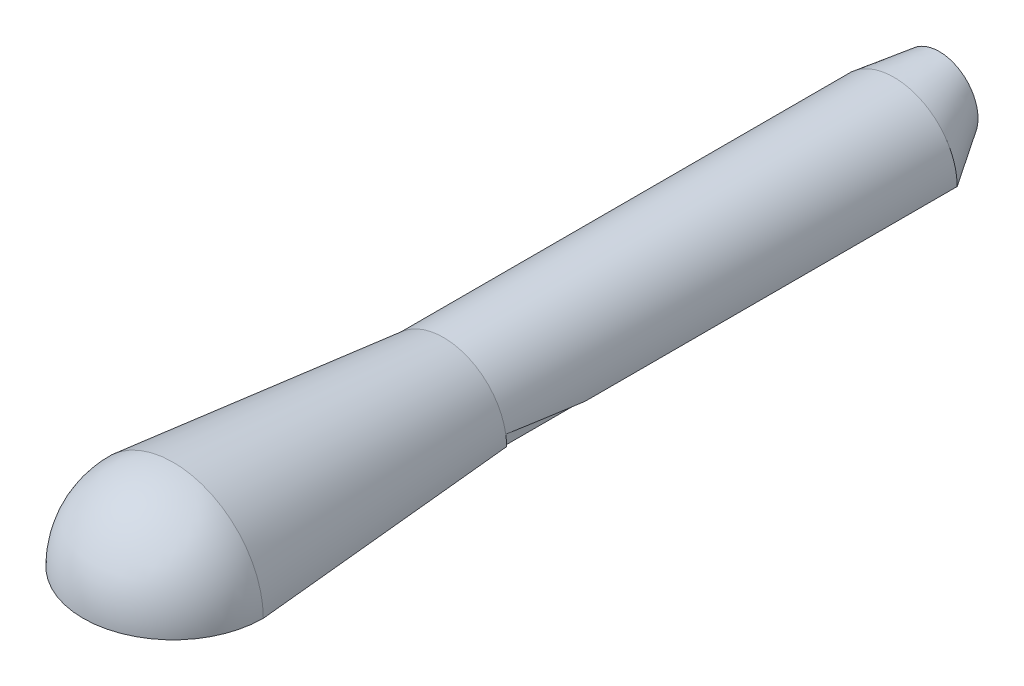
ISO-10303-21;
HEADER;
FILE_DESCRIPTION(('STEP AP214'),'2;1');
FILE_NAME('part.step','',(''),(''),'','','');
FILE_SCHEMA(('AUTOMOTIVE_DESIGN { 1 0 10303 214 1 1 1 1 }'));
ENDSEC;
DATA;
#1=APPLICATION_CONTEXT('core data for automotive mechanical design processes');
#2=APPLICATION_PROTOCOL_DEFINITION('international standard','automotive_design',2000,#1);
#3=PRODUCT_CONTEXT('',#1,'mechanical');
#4=PRODUCT('Part','Part','',(#3));
#5=PRODUCT_RELATED_PRODUCT_CATEGORY('part','',(#4));
#6=PRODUCT_DEFINITION_FORMATION('','',#4);
#7=PRODUCT_DEFINITION_CONTEXT('part definition',#1,'design');
#8=PRODUCT_DEFINITION('design','',#6,#7);
#9=PRODUCT_DEFINITION_SHAPE('','',#8);
#10=(LENGTH_UNIT() NAMED_UNIT(*) SI_UNIT(.MILLI.,.METRE.));
#11=(NAMED_UNIT(*) PLANE_ANGLE_UNIT() SI_UNIT($,.RADIAN.));
#12=(NAMED_UNIT(*) SI_UNIT($,.STERADIAN.) SOLID_ANGLE_UNIT());
#13=UNCERTAINTY_MEASURE_WITH_UNIT(LENGTH_MEASURE(1.E-05),#10,'distance_accuracy_value','');
#14=(GEOMETRIC_REPRESENTATION_CONTEXT(3) GLOBAL_UNCERTAINTY_ASSIGNED_CONTEXT((#13)) GLOBAL_UNIT_ASSIGNED_CONTEXT((#10,
#11,#12)) REPRESENTATION_CONTEXT('',''));
#15=CARTESIAN_POINT('',(0.,0.,0.));
#16=DIRECTION('',(0.,0.,1.));
#17=DIRECTION('',(1.,0.,0.));
#18=AXIS2_PLACEMENT_3D('',#15,#16,#17);
#19=CARTESIAN_POINT('',(0.,0.,0.));
#20=DIRECTION('',(0.,-1.,0.));
#21=DIRECTION('',(1.,0.,0.));
#22=AXIS2_PLACEMENT_3D('',#19,#20,#21);
#23=SPHERICAL_SURFACE('',#22,100.);
#24=CARTESIAN_POINT('',(0.,0.,0.));
#25=DIRECTION('',(0.,-1.,0.));
#26=DIRECTION('',(0.,0.,-1.));
#27=AXIS2_PLACEMENT_3D('',#24,#25,#26);
#28=CIRCLE('',#27,100.);
#29=CARTESIAN_POINT('',(100.,0.,-6.98296267768627E-13));
#30=VERTEX_POINT('',#29);
#31=CARTESIAN_POINT('',(-100.,0.,6.98296267768627E-13));
#32=VERTEX_POINT('',#31);
#33=EDGE_CURVE('E110',#30,#32,#28,.T.);
#34=ORIENTED_EDGE('',*,*,#33,.F.);
#35=CARTESIAN_POINT('',(100.,0.,-6.98296267768627E-13));
#36=CARTESIAN_POINT('',(100.000034708878,1.63624782608904,-6.98296510139423E-13));
#37=CARTESIAN_POINT('',(99.9598417125153,3.27249269879273,-6.98015843945921E-13));
#38=CARTESIAN_POINT('',(99.7992495285192,6.54104216669093,-6.96894434718748E-13));
#39=CARTESIAN_POINT('',(99.6788503408854,8.17334676188544,-6.96053691685078E-13));
#40=CARTESIAN_POINT('',(99.358094993554,11.4300813040267,-6.93813869065994E-13));
#41=CARTESIAN_POINT('',(99.1577388338565,13.0545112509735,-6.92414789480582E-13));
#42=CARTESIAN_POINT('',(98.6775631590997,16.2915836400989,-6.89061740665023E-13));
#43=CARTESIAN_POINT('',(98.3977436440406,17.9042260822774,-6.87107771434876E-13));
#44=CARTESIAN_POINT('',(97.7593124366055,21.1138383209483,-6.82649630141087E-13));
#45=CARTESIAN_POINT('',(97.4007007442297,22.7108081174406,-6.80145458077445E-13));
#46=CARTESIAN_POINT('',(96.6055498946791,25.8852278632122,-6.74592949371903E-13));
#47=CARTESIAN_POINT('',(96.1690107375045,27.4626778124916,-6.71544612730003E-13));
#48=CARTESIAN_POINT('',(95.2190564089373,30.5942576384009,-6.64911117108113E-13));
#49=CARTESIAN_POINT('',(94.7056412375449,32.1483875150308,-6.61325958128121E-13));
#50=CARTESIAN_POINT('',(93.6031717990593,35.2295831634133,-6.53627455185887E-13));
#51=CARTESIAN_POINT('',(93.0141175319661,36.7566489351659,-6.49514111223643E-13));
#52=CARTESIAN_POINT('',(91.7617889702913,39.7800375378521,-6.40769147617267E-13));
#53=CARTESIAN_POINT('',(91.0985146757097,41.2763603687857,-6.36137527973135E-13));
#54=CARTESIAN_POINT('',(89.699343948979,44.2346583172707,-6.26367171008664E-13));
#55=CARTESIAN_POINT('',(88.9634475168299,45.6966334348222,-6.21228433688324E-13));
#56=CARTESIAN_POINT('',(87.4208053528411,48.5827139303774,-6.10456221032165E-13));
#57=CARTESIAN_POINT('',(86.6140596210015,50.0068193083813,-6.04822745696346E-13));
#58=CARTESIAN_POINT('',(84.9316623790529,52.8137295302631,-5.93074628546778E-13));
#59=CARTESIAN_POINT('',(84.0560108689441,54.1965343741412,-5.86959986733028E-13));
#60=CARTESIAN_POINT('',(82.237911591565,56.9175122297793,-5.74264267334761E-13));
#61=CARTESIAN_POINT('',(81.2954638242948,58.2556852415394,-5.67683189750245E-13));
#62=CARTESIAN_POINT('',(79.3460424718342,60.8841756569473,-5.54070453202927E-13));
#63=CARTESIAN_POINT('',(78.3390688866436,62.1744930605951,-5.47038794240126E-13));
#64=CARTESIAN_POINT('',(76.2630217859038,64.7041637721341,-5.32541834818541E-13));
#65=CARTESIAN_POINT('',(75.1939482703545,65.9435170800254,-5.25076534359757E-13));
#66=CARTESIAN_POINT('',(72.9962768006373,68.3682738893783,-5.09730276508906E-13));
#67=CARTESIAN_POINT('',(71.8676788464695,69.55367739084,-5.01849319116839E-13));
#68=CARTESIAN_POINT('',(69.55367739084,71.8676788464695,-4.85690733316067E-13));
#69=CARTESIAN_POINT('',(68.3682738893783,72.9962768006373,-4.77413104907361E-13));
#70=CARTESIAN_POINT('',(65.9435170800254,75.1939482703545,-4.60481118605184E-13));
#71=CARTESIAN_POINT('',(64.7041637721341,76.2630217859038,-4.51826760711712E-13));
#72=CARTESIAN_POINT('',(62.174493060595,78.3390688866436,-4.34162164546199E-13));
#73=CARTESIAN_POINT('',(60.8841756569473,79.3460424718342,-4.25151926274158E-13));
#74=CARTESIAN_POINT('',(58.2556852415394,81.2954638242948,-4.06797275804708E-13));
#75=CARTESIAN_POINT('',(56.9175122297793,82.237911591565,-3.974528636073E-13));
#76=CARTESIAN_POINT('',(54.1965343741412,84.0560108689441,-3.78452376794569E-13));
#77=CARTESIAN_POINT('',(52.8137295302631,84.931662379053,-3.68796302179244E-13));
#78=CARTESIAN_POINT('',(50.0068193083812,86.6140596210015,-3.49195752860227E-13));
#79=CARTESIAN_POINT('',(48.5827139303774,87.4208053528411,-3.39251278156534E-13));
#80=CARTESIAN_POINT('',(45.6966334348222,88.9634475168299,-3.19097885771274E-13));
#81=CARTESIAN_POINT('',(44.2346583172707,89.699343948979,-3.08888968089706E-13));
#82=CARTESIAN_POINT('',(41.2763603687857,91.0985146757097,-2.88231283925959E-13));
#83=CARTESIAN_POINT('',(39.7800375378521,91.7617889702913,-2.7778251744378E-13));
#84=CARTESIAN_POINT('',(36.7566489351659,93.0141175319661,-2.5667030767108E-13));
#85=CARTESIAN_POINT('',(35.2295831634133,93.6031717990593,-2.46006864380559E-13));
#86=CARTESIAN_POINT('',(32.1483875150308,94.7056412375449,-2.24490990165255E-13));
#87=CARTESIAN_POINT('',(30.5942576384009,95.2190564089373,-2.13638559240471E-13));
#88=CARTESIAN_POINT('',(27.4626778124916,96.1690107375045,-1.91770854193952E-13));
#89=CARTESIAN_POINT('',(25.8852278632122,96.6055498946791,-1.80755580072216E-13));
#90=CARTESIAN_POINT('',(22.7108081174406,97.4007007442297,-1.58588725464182E-13));
#91=CARTESIAN_POINT('',(21.1138383209483,97.7593124366055,-1.47437144977884E-13));
#92=CARTESIAN_POINT('',(17.9042260822774,98.3977436440406,-1.250245425054E-13));
#93=CARTESIAN_POINT('',(16.2915836400989,98.6775631590997,-1.13763520519215E-13));
#94=CARTESIAN_POINT('',(13.0545112509735,99.1577388338565,0.));
#95=CARTESIAN_POINT('',(11.4300813040267,99.358094993554,0.));
#96=CARTESIAN_POINT('',(8.17334676188544,99.6788503408854,0.));
#97=CARTESIAN_POINT('',(6.54104216669093,99.7992495285192,0.));
#98=CARTESIAN_POINT('',(3.27249269879272,99.9598417125153,0.));
#99=CARTESIAN_POINT('',(1.63624782608903,100.000034708878,0.));
#100=CARTESIAN_POINT('',(0.,100.,0.));
#101=B_SPLINE_CURVE_WITH_KNOTS('',3,(#35,#36,#37,#38,#39,#40,#41,#42,#43,#44,#45,#46,#47,#48,
#49,#50,#51,#52,#53,#54,#55,#56,#57,#58,#59,#60,#61,#62,#63,#64,#65,#66,#67,#68,#69,#70,#71,#72,
#73,#74,#75,#76,#77,#78,#79,#80,#81,#82,#83,#84,#85,#86,#87,#88,#89,#90,#91,#92,#93,#94,#95,#96,
#97,#98,#99,#100),.UNSPECIFIED.,.F.,.F.,(4,2,2,2,2,2,2,2,2,2,2,2,2,2,2,2,2,2,2,2,2,2,2,2,2,2,2,
2,2,2,2,2,4),(0.,4.90824570458246,9.81649140916492,14.7247371137474,19.6329828183298,
24.5412285229123,29.4494742274947,34.3577199320772,39.2659656366597,44.1742113412421,
49.0824570458246,53.990702750407,58.8989484549895,63.8071941595719,68.7154398641544,
73.6236855687368,78.5319312733193,83.4401769779018,88.3484226824842,93.2566683870667,
98.1649140916491,103.073159796232,107.981405500814,112.889651205396,117.797896909979,
122.706142614561,127.614388319144,132.522634023726,137.430879728309,142.339125432891,
147.247371137474,152.155616842056,157.063862546639),.UNSPECIFIED.);
#102=CARTESIAN_POINT('',(0.,100.000104880312,0.));
#103=VERTEX_POINT('',#102);
#104=EDGE_CURVE('E125',#30,#103,#101,.T.);
#105=ORIENTED_EDGE('',*,*,#104,.T.);
#106=CARTESIAN_POINT('',(0.,100.,0.));
#107=CARTESIAN_POINT('',(-1.636247826089,100.000034708878,0.));
#108=CARTESIAN_POINT('',(-3.2724926987927,99.9598417125153,0.));
#109=CARTESIAN_POINT('',(-6.5410421666909,99.7992495285192,0.));
#110=CARTESIAN_POINT('',(-8.17334676188541,99.6788503408854,0.));
#111=CARTESIAN_POINT('',(-11.4300813040267,99.358094993554,0.));
#112=CARTESIAN_POINT('',(-13.0545112509735,99.1577388338565,0.));
#113=CARTESIAN_POINT('',(-16.2915836400988,98.6775631590997,1.15758664095003E-13));
#114=CARTESIAN_POINT('',(-17.9042260822774,98.3977436440406,1.27217177821687E-13));
#115=CARTESIAN_POINT('',(-21.1138383209482,97.7593124366055,1.5002284442963E-13));
#116=CARTESIAN_POINT('',(-22.7108081174405,97.4007007442297,1.61369997310889E-13));
#117=CARTESIAN_POINT('',(-25.8852278632122,96.6055498946791,1.83925606217004E-13));
#118=CARTESIAN_POINT('',(-27.4626778124916,96.1690107375045,1.9513406224186E-13));
#119=CARTESIAN_POINT('',(-30.5942576384008,95.2190564089373,2.17385275209387E-13));
#120=CARTESIAN_POINT('',(-32.1483875150307,94.7056412375449,2.28428032152058E-13));
#121=CARTESIAN_POINT('',(-35.2295831634132,93.6031717990593,2.50321244006196E-13));
#122=CARTESIAN_POINT('',(-36.7566489351659,93.0141175319661,2.61171698917663E-13));
#123=CARTESIAN_POINT('',(-39.7800375378521,91.7617889702913,2.82654167007849E-13));
#124=CARTESIAN_POINT('',(-41.2763603687857,91.0985146757097,2.93286180186568E-13));
#125=CARTESIAN_POINT('',(-44.2346583172707,89.699343948979,3.14306151361668E-13));
#126=CARTESIAN_POINT('',(-45.6966334348221,88.9634475168299,3.2469410935805E-13));
#127=CARTESIAN_POINT('',(-48.5827139303774,87.4208053528411,3.45200944667407E-13));
#128=CARTESIAN_POINT('',(-50.0068193083812,86.6140596210015,3.55319821980382E-13));
#129=CARTESIAN_POINT('',(-52.8137295302631,84.931662379053,3.75264118661271E-13));
#130=CARTESIAN_POINT('',(-54.1965343741411,84.0560108689441,3.85089538029185E-13));
#131=CARTESIAN_POINT('',(-56.9175122297793,82.237911591565,4.04423248524063E-13));
#132=CARTESIAN_POINT('',(-58.2556852415394,81.2954638242948,4.13931539651027E-13));
#133=CARTESIAN_POINT('',(-60.8841756569473,79.3460424718342,4.32608087357858E-13));
#134=CARTESIAN_POINT('',(-62.174493060595,78.3390688866436,4.41776343937725E-13));
#135=CARTESIAN_POINT('',(-64.7041637721341,76.2630217859038,4.59750735417217E-13));
#136=CARTESIAN_POINT('',(-65.9435170800253,75.1939482703545,4.68556870316841E-13));
#137=CARTESIAN_POINT('',(-68.3682738893783,72.9962768006373,4.85785803685547E-13));
#138=CARTESIAN_POINT('',(-69.55367739084,71.8676788464695,4.94208602154629E-13));
#139=CARTESIAN_POINT('',(-71.8676788464695,69.55367739084,5.10650571402987E-13));
#140=CARTESIAN_POINT('',(-72.9962768006373,68.3682738893783,5.18669742182264E-13));
#141=CARTESIAN_POINT('',(-75.1939482703545,65.9435170800254,5.34285137166211E-13));
#142=CARTESIAN_POINT('',(-76.2630217859038,64.7041637721341,5.41881361370882E-13));
#143=CARTESIAN_POINT('',(-78.3390688866436,62.174493060595,5.56632563236147E-13));
#144=CARTESIAN_POINT('',(-79.3460424718341,60.8841756569473,5.63787540896741E-13));
#145=CARTESIAN_POINT('',(-81.2954638242948,58.2556852415394,5.77639012706007E-13));
#146=CARTESIAN_POINT('',(-82.237911591565,56.9175122297793,5.84335506854678E-13));
#147=CARTESIAN_POINT('',(-84.056010868944,54.1965343741412,5.97253879199002E-13));
#148=CARTESIAN_POINT('',(-84.9316623790529,52.8137295302631,6.03475757394654E-13));
#149=CARTESIAN_POINT('',(-86.6140596210015,50.0068193083812,6.15429908783948E-13));
#150=CARTESIAN_POINT('',(-87.4208053528411,48.5827139303774,6.21162181977589E-13));
#151=CARTESIAN_POINT('',(-88.9634475168299,45.6966334348222,6.32123313812584E-13));
#152=CARTESIAN_POINT('',(-89.6993439489789,44.2346583172707,6.37352172453937E-13));
#153=CARTESIAN_POINT('',(-91.0985146757097,41.2763603687857,6.47293878413604E-13));
#154=CARTESIAN_POINT('',(-91.7617889702913,39.7800375378521,6.52006725731917E-13));
#155=CARTESIAN_POINT('',(-93.0141175319661,36.7566489351659,6.60905055354747E-13));
#156=CARTESIAN_POINT('',(-93.6031717990593,35.2295831634133,6.65090537659262E-13));
#157=CARTESIAN_POINT('',(-94.7056412375449,32.1483875150308,6.72924054168397E-13));
#158=CARTESIAN_POINT('',(-95.2190564089373,30.5942576384009,6.76572088373016E-13));
#159=CARTESIAN_POINT('',(-96.1690107375044,27.4626778124916,6.83321919847688E-13));
#160=CARTESIAN_POINT('',(-96.6055498946791,25.8852278632122,6.86423717117741E-13));
#161=CARTESIAN_POINT('',(-97.4007007442296,22.7108081174406,6.92073603717558E-13));
#162=CARTESIAN_POINT('',(-97.7593124366055,21.1138383209483,6.94621693047321E-13));
#163=CARTESIAN_POINT('',(-98.3977436440405,17.9042260822774,6.99158019614576E-13));
#164=CARTESIAN_POINT('',(-98.6775631590997,16.2915836400989,7.01146256852068E-13));
#165=CARTESIAN_POINT('',(-99.1577388338564,13.0545112509735,7.04558110227939E-13));
#166=CARTESIAN_POINT('',(-99.358094993554,11.4300813040267,7.05981726366318E-13));
#167=CARTESIAN_POINT('',(-99.6788503408853,8.17334676188543,7.08260830186343E-13));
#168=CARTESIAN_POINT('',(-99.7992495285192,6.54104216669092,7.09116317867989E-13));
#169=CARTESIAN_POINT('',(-99.9598417125152,3.27249269879272,7.10257393965572E-13));
#170=CARTESIAN_POINT('',(-100.000034708877,1.63624782608903,7.10542982381508E-13));
#171=CARTESIAN_POINT('',(-100.,0.,7.105427357601E-13));
#172=B_SPLINE_CURVE_WITH_KNOTS('',3,(#106,#107,#108,#109,#110,#111,#112,#113,#114,#115,#116,
#117,#118,#119,#120,#121,#122,#123,#124,#125,#126,#127,#128,#129,#130,#131,#132,#133,#134,#135,
#136,#137,#138,#139,#140,#141,#142,#143,#144,#145,#146,#147,#148,#149,#150,#151,#152,#153,#154,
#155,#156,#157,#158,#159,#160,#161,#162,#163,#164,#165,#166,#167,#168,#169,#170,#171),
.UNSPECIFIED.,.F.,.F.,(4,2,2,2,2,2,2,2,2,2,2,2,2,2,2,2,2,2,2,2,2,2,2,2,2,2,2,2,2,2,2,2,4),(0.,
4.90824570458246,9.81649140916493,14.7247371137474,19.6329828183298,24.5412285229123,
29.4494742274947,34.3577199320772,39.2659656366597,44.1742113412421,49.0824570458246,
53.990702750407,58.8989484549895,63.8071941595719,68.7154398641544,73.6236855687368,
78.5319312733193,83.4401769779018,88.3484226824842,93.2566683870667,98.1649140916491,
103.073159796232,107.981405500814,112.889651205397,117.797896909979,122.706142614561,
127.614388319144,132.522634023726,137.430879728309,142.339125432891,147.247371137474,
152.155616842056,157.063862546639),.UNSPECIFIED.);
#173=EDGE_CURVE('E307',#103,#32,#172,.T.);
#174=ORIENTED_EDGE('',*,*,#173,.T.);
#175=EDGE_LOOP('',(#34,#105,#174));
#176=FACE_BOUND('',#175,.T.);
#177=ADVANCED_FACE('F98',(#176),#23,.T.);
#178=CARTESIAN_POINT('',(0.,0.,0.));
#179=DIRECTION('',(0.,1.,0.));
#180=DIRECTION('',(0.,0.,1.));
#181=AXIS2_PLACEMENT_3D('',#178,#179,#180);
#182=PLANE('',#181);
#183=DIRECTION('',(0.,0.,-1.));
#184=VECTOR('',#183,1.);
#185=CARTESIAN_POINT('',(68.,-4.88807387438039E-13,-300.000000000001));
#186=LINE('',#185,#184);
#187=CARTESIAN_POINT('',(68.,-4.88807387438039E-13,-300.000000000001));
#188=VERTEX_POINT('',#187);
#189=CARTESIAN_POINT('',(68.,-4.78083155417905E-13,-387.57));
#190=VERTEX_POINT('',#189);
#191=EDGE_CURVE('E182',#188,#190,#186,.T.);
#192=ORIENTED_EDGE('',*,*,#191,.F.);
#193=DIRECTION('',(1.,0.,0.));
#194=VECTOR('',#193,1.);
#195=CARTESIAN_POINT('',(68.,-4.88807387438039E-13,-300.000000000001));
#196=LINE('',#195,#194);
#197=CARTESIAN_POINT('',(70.,-4.88807387438039E-13,-300.000000000001));
#198=VERTEX_POINT('',#197);
#199=EDGE_CURVE('E164',#188,#198,#196,.T.);
#200=ORIENTED_EDGE('',*,*,#199,.T.);
#201=DIRECTION('',(0.0995037190210059,0.,0.995037190209988));
#202=VECTOR('',#201,1.);
#203=CARTESIAN_POINT('',(84.999999999999,0.,-150.000000000001));
#204=LINE('',#203,#202);
#205=EDGE_CURVE('E103',#198,#30,#204,.T.);
#206=ORIENTED_EDGE('',*,*,#205,.T.);
#207=ORIENTED_EDGE('',*,*,#33,.T.);
#208=DIRECTION('',(-0.099503719020992,0.,0.99503719020999));
#209=VECTOR('',#208,1.);
#210=CARTESIAN_POINT('',(-85.0000000000011,0.,-149.999999999999));
#211=LINE('',#210,#209);
#212=CARTESIAN_POINT('',(-70.0000000000021,0.,-299.999999999999));
#213=VERTEX_POINT('',#212);
#214=EDGE_CURVE('E310',#213,#32,#211,.T.);
#215=ORIENTED_EDGE('',*,*,#214,.F.);
#216=DIRECTION('',(0.,0.,1.));
#217=VECTOR('',#216,1.);
#218=CARTESIAN_POINT('',(-70.0000000000056,0.,-800.));
#219=LINE('',#218,#217);
#220=CARTESIAN_POINT('',(-70.0000000000056,0.,-800.));
#221=VERTEX_POINT('',#220);
#222=EDGE_CURVE('E246',#221,#213,#219,.T.);
#223=ORIENTED_EDGE('',*,*,#222,.F.);
#224=DIRECTION('',(1.,0.,0.));
#225=VECTOR('',#224,1.);
#226=CARTESIAN_POINT('',(0.,0.,-800.));
#227=LINE('',#226,#225);
#228=CARTESIAN_POINT('',(69.9999999999944,-4.88807387438039E-13,-800.));
#229=VERTEX_POINT('',#228);
#230=EDGE_CURVE('E271',#229,#221,#227,.F.);
#231=ORIENTED_EDGE('',*,*,#230,.F.);
#232=DIRECTION('',(0.,0.,1.));
#233=VECTOR('',#232,1.);
#234=CARTESIAN_POINT('',(69.9999999999944,-4.88807387438039E-13,-800.));
#235=LINE('',#234,#233);
#236=CARTESIAN_POINT('',(69.9999999999973,-4.88807387438039E-13,-387.57));
#237=VERTEX_POINT('',#236);
#238=EDGE_CURVE('E314',#229,#237,#235,.T.);
#239=ORIENTED_EDGE('',*,*,#238,.T.);
#240=DIRECTION('',(1.,0.,0.));
#241=VECTOR('',#240,1.);
#242=CARTESIAN_POINT('',(68.,-4.78083155417905E-13,-387.57));
#243=LINE('',#242,#241);
#244=EDGE_CURVE('E118',#190,#237,#243,.T.);
#245=ORIENTED_EDGE('',*,*,#244,.F.);
#246=EDGE_LOOP('',(#192,#200,#206,#207,#215,#223,#231,#239,#245));
#247=FACE_BOUND('',#246,.T.);
#248=ADVANCED_FACE('F100',(#247),#182,.F.);
#249=CARTESIAN_POINT('',(-2.09488880330588E-12,0.,-300.));
#250=DIRECTION('',(0.,0.,1.));
#251=DIRECTION('',(1.,0.,0.));
#252=AXIS2_PLACEMENT_3D('',#249,#250,#251);
#253=CONICAL_SURFACE('',#252,70.,0.099668652491162);
#254=CARTESIAN_POINT('',(-2.09488880330588E-12,0.,-300.));
#255=DIRECTION('',(0.,0.,1.));
#256=DIRECTION('',(-1.,0.,0.));
#257=AXIS2_PLACEMENT_3D('',#254,#255,#256);
#258=CIRCLE('',#257,70.);
#259=CARTESIAN_POINT('',(69.053885480831,11.4699999999995,-300.000000000001));
#260=VERTEX_POINT('',#259);
#261=EDGE_CURVE('E171',#198,#260,#258,.T.);
#262=ORIENTED_EDGE('',*,*,#261,.T.);
#263=EDGE_CURVE('E287',#260,#213,#258,.T.);
#264=ORIENTED_EDGE('',*,*,#263,.T.);
#265=ORIENTED_EDGE('',*,*,#214,.T.);
#266=ORIENTED_EDGE('',*,*,#173,.F.);
#267=ORIENTED_EDGE('',*,*,#104,.F.);
#268=ORIENTED_EDGE('',*,*,#205,.F.);
#269=EDGE_LOOP('',(#262,#264,#265,#266,#267,#268));
#270=FACE_BOUND('',#269,.T.);
#271=ADVANCED_FACE('F257',(#270),#253,.T.);
#272=CARTESIAN_POINT('',(-5.58637014214901E-12,0.,-800.));
#273=DIRECTION('',(0.,0.,1.));
#274=DIRECTION('',(1.,0.,0.));
#275=AXIS2_PLACEMENT_3D('',#272,#273,#274);
#276=CYLINDRICAL_SURFACE('',#275,70.);
#277=ORIENTED_EDGE('',*,*,#263,.F.);
#278=CARTESIAN_POINT('',(-2.70638684499084E-12,0.,-387.569999999997));
#279=DIRECTION('',(0.,0.991530816583106,-0.129871628025673));
#280=DIRECTION('',(0.,0.129871628025673,0.991530816583106));
#281=AXIS2_PLACEMENT_3D('',#278,#279,#280);
#282=ELLIPSE('',#281,538.993782276774,70.);
#283=EDGE_CURVE('E12',#260,#237,#282,.T.);
#284=ORIENTED_EDGE('',*,*,#283,.T.);
#285=ORIENTED_EDGE('',*,*,#238,.F.);
#286=CARTESIAN_POINT('',(-70.0000000000056,0.,-800.));
#287=CARTESIAN_POINT('',(-70.0000000000056,2.91666666666667,-800.));
#288=CARTESIAN_POINT('',(-69.8190931161462,6.01743806614979,-800.));
#289=CARTESIAN_POINT('',(-68.9419688307676,12.5666327303104,-800.));
#290=CARTESIAN_POINT('',(-68.2453333333389,16.016,-800.));
#291=CARTESIAN_POINT('',(-66.1546666666723,23.184,-800.));
#292=CARTESIAN_POINT('',(-64.759500063129,26.903589614106,-800.));
#293=CARTESIAN_POINT('',(-62.002272440354,32.5594411480032,-800.));
#294=CARTESIAN_POINT('',(-60.972507168922,34.4566739162976,-800.));
#295=CARTESIAN_POINT('',(-58.6714097450358,38.2436228196075,-800.));
#296=CARTESIAN_POINT('',(-57.4000000000056,40.1333333333334,-800.));
#297=CARTESIAN_POINT('',(-54.6000000000055,43.8666666666667,-800.));
#298=CARTESIAN_POINT('',(-53.0713249126635,45.7102570993461,-800.));
#299=CARTESIAN_POINT('',(-49.7483472184952,49.3061363432769,-800.));
#300=CARTESIAN_POINT('',(-47.9539625946137,51.058359917433,-800.));
#301=CARTESIAN_POINT('',(-44.1008319259454,54.4210921373617,-800.));
#302=CARTESIAN_POINT('',(-42.0420207444237,56.0315007830871,-800.));
#303=CARTESIAN_POINT('',(-37.6732817466906,59.0574671884433,-800.));
#304=CARTESIAN_POINT('',(-35.3633217993135,60.4728950403692,-800.));
#305=CARTESIAN_POINT('',(-30.519031141874,63.0565167243369,-800.));
#306=CARTESIAN_POINT('',(-27.9847157944756,64.2245639017445,-800.));
#307=CARTESIAN_POINT('',(-22.7322653376108,66.2660021359915,-800.));
#308=CARTESIAN_POINT('',(-20.0142011834374,67.1392504930967,-800.));
#309=CARTESIAN_POINT('',(-14.4473372781119,68.5530571992111,-800.));
#310=CARTESIAN_POINT('',(-11.5986615997268,69.0935012894467,-800.));
#311=CARTESIAN_POINT('',(-5.83324501506996,69.8170045471292,-800.));
#312=CARTESIAN_POINT('',(-2.91666666667205,70.,-800.));
#313=CARTESIAN_POINT('',(2.91666666666131,70.,-800.));
#314=CARTESIAN_POINT('',(5.83324501505923,69.8170045471291,-800.));
#315=CARTESIAN_POINT('',(11.5986615997161,69.0935012894467,-800.));
#316=CARTESIAN_POINT('',(14.4473372781012,68.553057199211,-800.));
#317=CARTESIAN_POINT('',(20.0142011834266,67.1392504930966,-800.));
#318=CARTESIAN_POINT('',(22.7322653376,66.2660021359914,-800.));
#319=CARTESIAN_POINT('',(27.9847157944648,64.2245639017443,-800.));
#320=CARTESIAN_POINT('',(30.5190311418632,63.0565167243367,-800.));
#321=CARTESIAN_POINT('',(35.3633217993027,60.4728950403689,-800.));
#322=CARTESIAN_POINT('',(37.6732817466798,59.057467188443,-800.));
#323=CARTESIAN_POINT('',(42.0420207444128,56.0315007830868,-800.));
#324=CARTESIAN_POINT('',(44.1008319259345,54.4210921373614,-800.));
#325=CARTESIAN_POINT('',(47.9539625946028,51.0583599174326,-800.));
#326=CARTESIAN_POINT('',(49.7483472184843,49.3061363432766,-800.));
#327=CARTESIAN_POINT('',(53.0713249126526,45.7102570993458,-800.));
#328=CARTESIAN_POINT('',(54.5999999999947,43.8666666666664,-800.));
#329=CARTESIAN_POINT('',(57.3999999999947,40.133333333333,-800.));
#330=CARTESIAN_POINT('',(58.6714097450248,38.2436228196071,-800.));
#331=CARTESIAN_POINT('',(60.972507168911,34.4566739162972,-800.));
#332=CARTESIAN_POINT('',(62.0022724403431,32.5594411480028,-800.000000000001));
#333=CARTESIAN_POINT('',(64.759500063118,26.9035896141056,-800.000000000001));
#334=CARTESIAN_POINT('',(66.1546666666612,23.1839999999996,-800.));
#335=CARTESIAN_POINT('',(68.2453333333278,16.0159999999996,-800.));
#336=CARTESIAN_POINT('',(68.9419688307565,12.5666327303099,-800.000000000001));
#337=CARTESIAN_POINT('',(69.8190931161351,6.01743806614932,-800.));
#338=CARTESIAN_POINT('',(69.9999999999944,2.9166666666662,-800.));
#339=CARTESIAN_POINT('',(69.9999999999944,-4.88807387438039E-13,-800.));
#340=B_SPLINE_CURVE_WITH_KNOTS('',3,(#286,#287,#288,#289,#290,#291,#292,#293,#294,#295,#296,
#297,#298,#299,#300,#301,#302,#303,#304,#305,#306,#307,#308,#309,#310,#311,#312,#313,#314,#315,
#316,#317,#318,#319,#320,#321,#322,#323,#324,#325,#326,#327,#328,#329,#330,#331,#332,#333,#334,
#335,#336,#337,#338,#339),.UNSPECIFIED.,.F.,.F.,(4,2,2,2,2,2,2,2,2,2,2,2,2,2,2,2,2,2,2,2,2,2,2,
2,2,2,4),(0.,0.0624999999999998,0.125,0.1875,0.21875,0.25,0.28125,0.3125,0.34375,
0.374999999999999,0.406249999999999,0.437499999999999,0.468749999999999,0.499999999999999,
0.531249999999999,0.562499999999999,0.593749999999999,0.624999999999999,0.656249999999999,
0.687499999999999,0.718749999999999,0.749999999999999,0.78125,0.8125,0.875,0.9375,1.),.UNSPECIFIED.);
#341=EDGE_CURVE('E280',#221,#229,#340,.T.);
#342=ORIENTED_EDGE('',*,*,#341,.F.);
#343=ORIENTED_EDGE('',*,*,#222,.T.);
#344=EDGE_LOOP('',(#277,#284,#285,#342,#343));
#345=FACE_BOUND('',#344,.T.);
#346=ADVANCED_FACE('F219',(#345),#276,.T.);
#347=CARTESIAN_POINT('',(0.201936357569298,26.9522789170263,-850.));
#348=DIRECTION('',(0.,0.,-1.));
#349=DIRECTION('',(-1.,0.,0.));
#350=AXIS2_PLACEMENT_3D('',#347,#348,#349);
#351=PLANE('',#350);
#352=CARTESIAN_POINT('',(0.201936357569298,26.9522789170263,-850.));
#353=DIRECTION('',(0.,0.,-1.));
#354=DIRECTION('',(-1.,0.,0.));
#355=AXIS2_PLACEMENT_3D('',#352,#353,#354);
#356=CIRCLE('',#355,42.93);
#357=CARTESIAN_POINT('',(-41.4462811736698,16.5402245342166,-850.));
#358=VERTEX_POINT('',#357);
#359=CARTESIAN_POINT('',(41.8501538888084,16.5402245342163,-850.));
#360=VERTEX_POINT('',#359);
#361=EDGE_CURVE('E459',#358,#360,#356,.T.);
#362=ORIENTED_EDGE('',*,*,#361,.T.);
#363=EDGE_CURVE('E196',#360,#358,#356,.T.);
#364=ORIENTED_EDGE('',*,*,#363,.T.);
#365=EDGE_LOOP('',(#362,#364));
#366=FACE_BOUND('',#365,.T.);
#367=ADVANCED_FACE('F214',(#366),#351,.T.);
#368=CARTESIAN_POINT('',(-70.0000000000056,0.,-800.));
#369=CARTESIAN_POINT('',(-41.4462811736698,16.5402245342166,-850.));
#370=CARTESIAN_POINT('',(-70.0000000000056,2.91666666666667,-800.));
#371=CARTESIAN_POINT('',(-41.9548371280042,18.5744483515542,-850.));
#372=CARTESIAN_POINT('',(-69.8190931161462,6.01743806614979,-800.));
#373=CARTESIAN_POINT('',(-42.3504736878314,20.7855784754368,-850.));
#374=CARTESIAN_POINT('',(-68.9419688307676,12.5666327303104,-800.));
#375=CARTESIAN_POINT('',(-42.7725466182384,25.5631756198491,-850.));
#376=CARTESIAN_POINT('',(-68.2453333333389,16.016,-800.));
#377=CARTESIAN_POINT('',(-42.7984974432772,28.1307825149695,-850.));
#378=CARTESIAN_POINT('',(-66.1546666666723,23.184,-800.));
#379=CARTESIAN_POINT('',(-42.3034874085321,33.5640206130911,-850.));
#380=CARTESIAN_POINT('',(-64.759500063129,26.903589614106,-800.));
#381=CARTESIAN_POINT('',(-41.7810602051062,36.4307202374547,-850.));
#382=CARTESIAN_POINT('',(-62.002272440354,32.5594411480032,-800.));
#383=CARTESIAN_POINT('',(-40.4488292284724,40.8395804846561,-850.));
#384=CARTESIAN_POINT('',(-60.972507168922,34.4566739162976,-800.));
#385=CARTESIAN_POINT('',(-39.9134097026822,42.3264707883897,-850.));
#386=CARTESIAN_POINT('',(-58.6714097450358,38.2436228196075,-800.));
#387=CARTESIAN_POINT('',(-38.6413258026152,45.3046016579333,-850.));
#388=CARTESIAN_POINT('',(-57.4000000000056,40.1333333333334,-800.));
#389=CARTESIAN_POINT('',(-37.9045700586264,46.7958148666395,-850.));
#390=CARTESIAN_POINT('',(-54.6000000000055,43.8666666666667,-800.));
#391=CARTESIAN_POINT('',(-36.2171077828473,49.7453694079961,-850.));
#392=CARTESIAN_POINT('',(-53.0713249126635,45.7102570993461,-800.));
#393=CARTESIAN_POINT('',(-35.2663128426906,51.2036451279574,-850.));
#394=CARTESIAN_POINT('',(-49.7483472184952,49.3061363432769,-800.));
#395=CARTESIAN_POINT('',(-33.1468363251907,54.0444332237998,-850.));
#396=CARTESIAN_POINT('',(-47.9539625946137,51.058359917433,-800.));
#397=CARTESIAN_POINT('',(-31.9780875101125,55.4268404455155,-850.));
#398=CARTESIAN_POINT('',(-44.1008319259454,54.4210921373617,-800.));
#399=CARTESIAN_POINT('',(-29.4299470086601,58.0698957688108,-850.));
#400=CARTESIAN_POINT('',(-42.0420207444237,56.0315007830871,-800.));
#401=CARTESIAN_POINT('',(-28.0505289688152,59.3304077931791,-850.));
#402=CARTESIAN_POINT('',(-37.6732817466906,59.0574671884433,-800.));
#403=CARTESIAN_POINT('',(-25.1009527530072,61.6842358039797,-850.));
#404=CARTESIAN_POINT('',(-35.3633217993135,60.4728950403692,-800.));
#405=CARTESIAN_POINT('',(-23.530824193327,62.7774043176448,-850.));
#406=CARTESIAN_POINT('',(-30.519031141874,63.0565167243369,-800.));
#407=CARTESIAN_POINT('',(-20.2323902805417,64.7560066192412,-850.));
#408=CARTESIAN_POINT('',(-27.9847157944756,64.2245639017445,-800.));
#409=CARTESIAN_POINT('',(-18.5041743892288,65.6413087205908,-850.));
#410=CARTESIAN_POINT('',(-22.7322653376108,66.2660021359915,-800.));
#411=CARTESIAN_POINT('',(-14.933004861194,67.1728353616748,-850.));
#412=CARTESIAN_POINT('',(-20.0142011834374,67.1392504930967,-800.));
#413=CARTESIAN_POINT('',(-13.0901893983985,67.8189713908306,-850.));
#414=CARTESIAN_POINT('',(-14.4473372781119,68.5530571992111,-800.));
#415=CARTESIAN_POINT('',(-9.34066261692311,68.8534240764724,-850.));
#416=CARTESIAN_POINT('',(-11.5986615997268,69.0935012894467,-800.));
#417=CARTESIAN_POINT('',(-7.43411369314256,69.2417140018028,-850.));
#418=CARTESIAN_POINT('',(-5.83324501506996,69.8170045471292,-800.));
#419=CARTESIAN_POINT('',(-3.61075065851175,69.7561221776952,-850.));
#420=CARTESIAN_POINT('',(-2.91666666667205,70.,-800.));
#421=CARTESIAN_POINT('',(-1.69409248096155,69.8822789170263,-850.));
#422=CARTESIAN_POINT('',(2.91666666666131,70.,-800.));
#423=CARTESIAN_POINT('',(2.09796519610044,69.8822789170263,-850.));
#424=CARTESIAN_POINT('',(5.83324501505923,69.8170045471291,-800.));
#425=CARTESIAN_POINT('',(4.01462337365064,69.7561221776951,-850.));
#426=CARTESIAN_POINT('',(11.5986615997161,69.0935012894467,-800.));
#427=CARTESIAN_POINT('',(7.83798640828146,69.2417140018027,-850.));
#428=CARTESIAN_POINT('',(14.4473372781012,68.553057199211,-800.));
#429=CARTESIAN_POINT('',(9.74453533206199,68.8534240764723,-850.));
#430=CARTESIAN_POINT('',(20.0142011834266,67.1392504930966,-800.));
#431=CARTESIAN_POINT('',(13.4940621135374,67.8189713908305,-850.));
#432=CARTESIAN_POINT('',(22.7322653376,66.2660021359914,-800.));
#433=CARTESIAN_POINT('',(15.3368775763329,67.1728353616747,-850.));
#434=CARTESIAN_POINT('',(27.9847157944648,64.2245639017443,-800.));
#435=CARTESIAN_POINT('',(18.9080471043677,65.6413087205907,-850.000000000001));
#436=CARTESIAN_POINT('',(30.5190311418632,63.0565167243367,-800.));
#437=CARTESIAN_POINT('',(20.6362629956806,64.756006619241,-850.000000000001));
#438=CARTESIAN_POINT('',(35.3633217993027,60.4728950403689,-800.));
#439=CARTESIAN_POINT('',(23.9346969084659,62.7774043176446,-850.));
#440=CARTESIAN_POINT('',(37.6732817466798,59.057467188443,-800.));
#441=CARTESIAN_POINT('',(25.5048254681461,61.6842358039795,-850.));
#442=CARTESIAN_POINT('',(42.0420207444128,56.0315007830868,-800.));
#443=CARTESIAN_POINT('',(28.454401683954,59.3304077931789,-850.));
#444=CARTESIAN_POINT('',(44.1008319259345,54.4210921373614,-800.));
#445=CARTESIAN_POINT('',(29.8338197237989,58.0698957688106,-850.000000000001));
#446=CARTESIAN_POINT('',(47.9539625946028,51.0583599174326,-800.));
#447=CARTESIAN_POINT('',(32.3819602252513,55.4268404455153,-850.));
#448=CARTESIAN_POINT('',(49.7483472184843,49.3061363432766,-800.));
#449=CARTESIAN_POINT('',(33.5507090403295,54.0444332237996,-850.));
#450=CARTESIAN_POINT('',(53.0713249126526,45.7102570993458,-800.));
#451=CARTESIAN_POINT('',(35.6701855578294,51.2036451279571,-850.000000000001));
#452=CARTESIAN_POINT('',(54.5999999999947,43.8666666666664,-800.));
#453=CARTESIAN_POINT('',(36.6209804979861,49.7453694079958,-850.));
#454=CARTESIAN_POINT('',(57.3999999999947,40.133333333333,-800.));
#455=CARTESIAN_POINT('',(38.3084427737651,46.7958148666392,-850.));
#456=CARTESIAN_POINT('',(58.6714097450248,38.2436228196071,-800.));
#457=CARTESIAN_POINT('',(39.0451985177539,45.3046016579331,-850.));
#458=CARTESIAN_POINT('',(60.972507168911,34.4566739162972,-800.));
#459=CARTESIAN_POINT('',(40.3172824178209,42.3264707883894,-850.));
#460=CARTESIAN_POINT('',(62.0022724403431,32.5594411480028,-800.000000000001));
#461=CARTESIAN_POINT('',(40.8527019436111,40.8395804846558,-850.000000000001));
#462=CARTESIAN_POINT('',(64.759500063118,26.9035896141056,-800.000000000001));
#463=CARTESIAN_POINT('',(42.1849329202448,36.4307202374544,-850.000000000001));
#464=CARTESIAN_POINT('',(66.1546666666612,23.1839999999996,-800.));
#465=CARTESIAN_POINT('',(42.7073601236708,33.5640206130908,-850.000000000001));
#466=CARTESIAN_POINT('',(68.2453333333278,16.0159999999996,-800.));
#467=CARTESIAN_POINT('',(43.2023701584158,28.1307825149693,-850.000000000001));
#468=CARTESIAN_POINT('',(68.9419688307565,12.5666327303099,-800.000000000001));
#469=CARTESIAN_POINT('',(43.1764193333771,25.5631756198488,-850.));
#470=CARTESIAN_POINT('',(69.8190931161351,6.01743806614932,-800.));
#471=CARTESIAN_POINT('',(42.75434640297,20.7855784754366,-850.));
#472=CARTESIAN_POINT('',(69.9999999999944,2.9166666666662,-800.));
#473=CARTESIAN_POINT('',(42.3587098431428,18.5744483515539,-850.000000000001));
#474=CARTESIAN_POINT('',(69.9999999999944,-4.88807387438039E-13,-800.));
#475=CARTESIAN_POINT('',(41.8501538888084,16.5402245342163,-850.));
#476=B_SPLINE_SURFACE_WITH_KNOTS('',3,1,((#368,#369),(#370,#371),(#372,#373),(#374,#375),(#376,
#377),(#378,#379),(#380,#381),(#382,#383),(#384,#385),(#386,#387),(#388,#389),(#390,#391),(#392,
#393),(#394,#395),(#396,#397),(#398,#399),(#400,#401),(#402,#403),(#404,#405),(#406,#407),(#408,
#409),(#410,#411),(#412,#413),(#414,#415),(#416,#417),(#418,#419),(#420,#421),(#422,#423),(#424,
#425),(#426,#427),(#428,#429),(#430,#431),(#432,#433),(#434,#435),(#436,#437),(#438,#439),(#440,
#441),(#442,#443),(#444,#445),(#446,#447),(#448,#449),(#450,#451),(#452,#453),(#454,#455),(#456,
#457),(#458,#459),(#460,#461),(#462,#463),(#464,#465),(#466,#467),(#468,#469),(#470,#471),(#472,
#473),(#474,#475)),.UNSPECIFIED.,.F.,.F.,.F.,(4,2,2,2,2,2,2,2,2,2,2,2,2,2,2,2,2,2,2,2,2,2,2,2,2,
2,4),(2,2),(0.,0.0624999999999998,0.125,0.1875,0.21875,0.25,0.28125,0.3125,0.34375,
0.374999999999999,0.406249999999999,0.437499999999999,0.468749999999999,0.499999999999999,
0.531249999999999,0.562499999999999,0.593749999999999,0.624999999999999,0.656249999999999,
0.687499999999999,0.718749999999999,0.749999999999999,0.78125,0.8125,0.875,0.9375,1.),(0.,1.),.UNSPECIFIED.);
#477=DIRECTION('',(-0.471395888324146,0.276981757079292,-0.837297451755561));
#478=VECTOR('',#477,1.);
#479=CARTESIAN_POINT('',(55.9250769444014,8.27011226710793,-825.));
#480=LINE('',#479,#478);
#481=EDGE_CURVE('E449',#229,#360,#480,.T.);
#482=DIRECTION('',(-0.476631092662801,-0.276096621269539,0.834621745002255));
#483=VECTOR('',#482,1.);
#484=CARTESIAN_POINT('',(-55.7231405868377,8.2701122671083,-825.));
#485=LINE('',#484,#483);
#486=EDGE_CURVE('E450',#358,#221,#485,.T.);
#487=ORIENTED_EDGE('',*,*,#341,.T.);
#488=ORIENTED_EDGE('',*,*,#481,.T.);
#489=ORIENTED_EDGE('',*,*,#361,.F.);
#490=ORIENTED_EDGE('',*,*,#486,.T.);
#491=EDGE_LOOP('',(#487,#488,#489,#490));
#492=FACE_BOUND('',#491,.T.);
#493=ADVANCED_FACE('F218',(#492),#476,.T.);
#494=CARTESIAN_POINT('',(69.9999999999944,-4.88807387438039E-13,-800.));
#495=CARTESIAN_POINT('',(41.8501538888084,16.5402245342163,-850.));
#496=CARTESIAN_POINT('',(67.0833333333277,-4.78623900199746E-13,-800.));
#497=CARTESIAN_POINT('',(41.4292715358672,14.8566951224516,-850.000000000001));
#498=CARTESIAN_POINT('',(64.1666666666611,-4.68440412961454E-13,-800.));
#499=CARTESIAN_POINT('',(40.8864247230614,13.118118586384,-850.));
#500=CARTESIAN_POINT('',(58.3333333333277,-4.48073438484869E-13,-800.));
#501=CARTESIAN_POINT('',(39.5016553472858,9.56999848708557,-850.));
#502=CARTESIAN_POINT('',(55.4166666666611,-4.37889951246576E-13,-800.));
#503=CARTESIAN_POINT('',(38.6594438311404,7.76031803452738,-850.));
#504=CARTESIAN_POINT('',(49.5833333333277,-4.17522976769991E-13,-800.));
#505=CARTESIAN_POINT('',(36.6239407634683,4.13235694845204,-850.));
#506=CARTESIAN_POINT('',(46.6666666666611,-4.07339489531699E-13,-800.));
#507=CARTESIAN_POINT('',(35.4302336664737,2.31406609737536,-850.));
#508=CARTESIAN_POINT('',(40.8333333333277,-3.86972515055114E-13,-800.));
#509=CARTESIAN_POINT('',(32.653813456506,-1.24258116396154,-850.));
#510=CARTESIAN_POINT('',(37.916666666661,-3.76789027816821E-13,-800.));
#511=CARTESIAN_POINT('',(31.0706193946346,-2.98071716059415,-850.));
#512=CARTESIAN_POINT('',(32.0833333333277,-3.56422053340237E-13,-800.));
#513=CARTESIAN_POINT('',(27.5051473619523,-6.26510381364319,-850.000000000001));
#514=CARTESIAN_POINT('',(29.1666666666611,-3.46238566101944E-13,-800.));
#515=CARTESIAN_POINT('',(25.5224727363941,-7.81083402541988,-850.));
#516=CARTESIAN_POINT('',(23.3333333333277,-3.25871591625359E-13,-800.));
#517=CARTESIAN_POINT('',(21.1896454999586,-10.5859635686725,-850.));
#518=CARTESIAN_POINT('',(20.4166666666611,-3.15688104387067E-13,-800.));
#519=CARTESIAN_POINT('',(18.8393926514099,-11.8145889073601,-850.));
#520=CARTESIAN_POINT('',(14.5833333333277,-2.95321129910482E-13,-800.));
#521=CARTESIAN_POINT('',(13.8529949665547,-13.8383256000964,-850.));
#522=CARTESIAN_POINT('',(11.666666666661,-2.85137642672189E-13,-800.));
#523=CARTESIAN_POINT('',(11.2172142375588,-14.6326238402725,-850.));
#524=CARTESIAN_POINT('',(5.8333333333277,-2.64770668195604E-13,-800.));
#525=CARTESIAN_POINT('',(5.78789421067044,-15.7025866784806,-850.));
#526=CARTESIAN_POINT('',(2.91666666666103,-2.54587180957312E-13,-800.));
#527=CARTESIAN_POINT('',(2.99516395148095,-15.9777210829737,-850.));
#528=CARTESIAN_POINT('',(-2.91666666667229,-2.34220206480727E-13,-800.));
#529=CARTESIAN_POINT('',(-2.59129123634263,-15.9777210829737,-850.));
#530=CARTESIAN_POINT('',(-5.83333333333896,-2.24036719242434E-13,-800.));
#531=CARTESIAN_POINT('',(-5.38402149553211,-15.7025866784806,-850.));
#532=CARTESIAN_POINT('',(-11.6666666666723,-2.03669744765849E-13,-800.));
#533=CARTESIAN_POINT('',(-10.8133415224204,-14.6326238402724,-850.));
#534=CARTESIAN_POINT('',(-14.583333333339,-1.93486257527557E-13,-800.));
#535=CARTESIAN_POINT('',(-13.4491222514164,-13.8383256000963,-850.));
#536=CARTESIAN_POINT('',(-20.4166666666723,-1.73119283050972E-13,-800.));
#537=CARTESIAN_POINT('',(-18.4355199362715,-11.81458890736,-850.));
#538=CARTESIAN_POINT('',(-23.333333333339,-1.62935795812679E-13,-800.));
#539=CARTESIAN_POINT('',(-20.7857727848203,-10.5859635686724,-850.));
#540=CARTESIAN_POINT('',(-29.1666666666723,-1.42568821336095E-13,-800.));
#541=CARTESIAN_POINT('',(-25.1186000212557,-7.81083402541972,-850.));
#542=CARTESIAN_POINT('',(-32.0833333333389,-1.32385334097802E-13,-800.));
#543=CARTESIAN_POINT('',(-27.1012746468139,-6.26510381364303,-850.));
#544=CARTESIAN_POINT('',(-37.9166666666723,-1.12018359621217E-13,-800.));
#545=CARTESIAN_POINT('',(-30.6667466794962,-2.98071716059395,-850.));
#546=CARTESIAN_POINT('',(-40.833333333339,-1.01834872382925E-13,-800.));
#547=CARTESIAN_POINT('',(-32.2499407413676,-1.24258116396134,-850.));
#548=CARTESIAN_POINT('',(-46.6666666666723,0.,-800.));
#549=CARTESIAN_POINT('',(-35.0263609513353,2.31406609737558,-850.));
#550=CARTESIAN_POINT('',(-49.583333333339,0.,-800.));
#551=CARTESIAN_POINT('',(-36.2200680483298,4.13235694845227,-850.));
#552=CARTESIAN_POINT('',(-55.4166666666723,0.,-800.));
#553=CARTESIAN_POINT('',(-38.2555711160019,7.76031803452762,-850.));
#554=CARTESIAN_POINT('',(-58.333333333339,0.,-800.));
#555=CARTESIAN_POINT('',(-39.0977826321473,9.56999848708581,-850.));
#556=CARTESIAN_POINT('',(-64.1666666666723,0.,-800.));
#557=CARTESIAN_POINT('',(-40.4825520079229,13.1181185863842,-850.));
#558=CARTESIAN_POINT('',(-67.0833333333389,0.,-800.));
#559=CARTESIAN_POINT('',(-41.0253988207286,14.8566951224519,-850.));
#560=CARTESIAN_POINT('',(-70.0000000000056,0.,-800.));
#561=CARTESIAN_POINT('',(-41.4462811736698,16.5402245342166,-850.));
#562=B_SPLINE_SURFACE_WITH_KNOTS('',3,1,((#494,#495),(#496,#497),(#498,#499),(#500,#501),(#502,
#503),(#504,#505),(#506,#507),(#508,#509),(#510,#511),(#512,#513),(#514,#515),(#516,#517),(#518,
#519),(#520,#521),(#522,#523),(#524,#525),(#526,#527),(#528,#529),(#530,#531),(#532,#533),(#534,
#535),(#536,#537),(#538,#539),(#540,#541),(#542,#543),(#544,#545),(#546,#547),(#548,#549),(#550,
#551),(#552,#553),(#554,#555),(#556,#557),(#558,#559),(#560,#561)),.UNSPECIFIED.,.F.,.F.,.F.,(4,
2,2,2,2,2,2,2,2,2,2,2,2,2,2,2,4),(2,2),(0.,0.0625,0.125,0.1875,0.25,0.3125,0.375,0.4375,0.5,
0.5625,0.625,0.6875,0.75,0.8125,0.875,0.9375,1.),(0.,1.),.UNSPECIFIED.);
#563=ORIENTED_EDGE('',*,*,#230,.T.);
#564=ORIENTED_EDGE('',*,*,#486,.F.);
#565=ORIENTED_EDGE('',*,*,#363,.F.);
#566=ORIENTED_EDGE('',*,*,#481,.F.);
#567=EDGE_LOOP('',(#563,#564,#565,#566));
#568=FACE_BOUND('',#567,.T.);
#569=ADVANCED_FACE('F212',(#568),#562,.T.);
#570=CARTESIAN_POINT('',(68.,-4.88807387438039E-13,-300.000000000001));
#571=DIRECTION('',(0.,0.,1.));
#572=DIRECTION('',(1.,0.,0.));
#573=AXIS2_PLACEMENT_3D('',#570,#571,#572);
#574=PLANE('',#573);
#575=ORIENTED_EDGE('',*,*,#199,.F.);
#576=DIRECTION('',(0.,-1.,0.));
#577=VECTOR('',#576,1.);
#578=CARTESIAN_POINT('',(68.,-4.88807387438039E-13,-300.000000000001));
#579=LINE('',#578,#577);
#580=CARTESIAN_POINT('',(68.,11.4699999999995,-300.000000000001));
#581=VERTEX_POINT('',#580);
#582=EDGE_CURVE('E168',#581,#188,#579,.T.);
#583=ORIENTED_EDGE('',*,*,#582,.F.);
#584=DIRECTION('',(1.,0.,0.));
#585=VECTOR('',#584,1.);
#586=CARTESIAN_POINT('',(68.,11.4699999999995,-300.000000000001));
#587=LINE('',#586,#585);
#588=EDGE_CURVE('E194',#581,#260,#587,.T.);
#589=ORIENTED_EDGE('',*,*,#588,.T.);
#590=ORIENTED_EDGE('',*,*,#261,.F.);
#591=EDGE_LOOP('',(#575,#583,#589,#590));
#592=FACE_BOUND('',#591,.T.);
#593=ADVANCED_FACE('F166',(#592),#574,.F.);
#594=CARTESIAN_POINT('',(68.,11.4699999999995,-300.000000000001));
#595=DIRECTION('',(0.,0.991530816583106,-0.129871628025673));
#596=DIRECTION('',(0.,0.129871628025673,0.991530816583106));
#597=AXIS2_PLACEMENT_3D('',#594,#595,#596);
#598=PLANE('',#597);
#599=ORIENTED_EDGE('',*,*,#588,.F.);
#600=DIRECTION('',(0.,0.129871628025673,0.991530816583106));
#601=VECTOR('',#600,1.);
#602=CARTESIAN_POINT('',(68.,11.4699999999995,-300.000000000001));
#603=LINE('',#602,#601);
#604=EDGE_CURVE('E178',#190,#581,#603,.T.);
#605=ORIENTED_EDGE('',*,*,#604,.F.);
#606=ORIENTED_EDGE('',*,*,#244,.T.);
#607=ORIENTED_EDGE('',*,*,#283,.F.);
#608=EDGE_LOOP('',(#599,#605,#606,#607));
#609=FACE_BOUND('',#608,.T.);
#610=ADVANCED_FACE('F211',(#609),#598,.F.);
#611=CARTESIAN_POINT('',(68.,0.,0.));
#612=DIRECTION('',(-1.,0.,0.));
#613=DIRECTION('',(0.,0.,1.));
#614=AXIS2_PLACEMENT_3D('',#611,#612,#613);
#615=PLANE('',#614);
#616=ORIENTED_EDGE('',*,*,#582,.T.);
#617=ORIENTED_EDGE('',*,*,#191,.T.);
#618=ORIENTED_EDGE('',*,*,#604,.T.);
#619=EDGE_LOOP('',(#616,#617,#618));
#620=FACE_BOUND('',#619,.T.);
#621=ADVANCED_FACE('F181',(#620),#615,.F.);
#622=CLOSED_SHELL('',(#177,#248,#271,#346,#367,#493,#569,#593,#610,#621));
#623=MANIFOLD_SOLID_BREP('B2',#622);
#624=ADVANCED_BREP_SHAPE_REPRESENTATION('',(#18,#623),#14);
#625=SHAPE_DEFINITION_REPRESENTATION(#9,#624);
ENDSEC;
END-ISO-10303-21;
